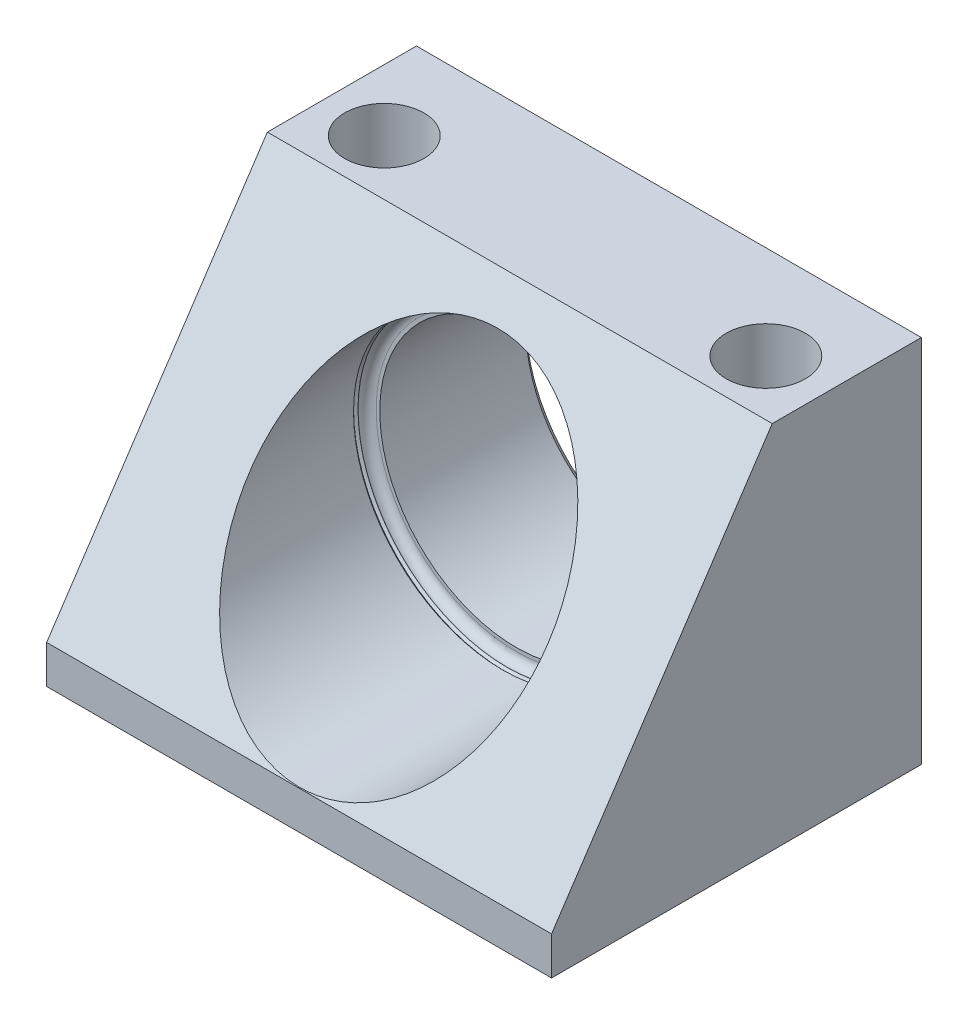
ISO-10303-21;
HEADER;
FILE_DESCRIPTION(('STEP AP214'),'2;1');
FILE_NAME('part.step','',(''),(''),'','','');
FILE_SCHEMA(('AUTOMOTIVE_DESIGN { 1 0 10303 214 1 1 1 1 }'));
ENDSEC;
DATA;
#1=APPLICATION_CONTEXT('core data for automotive mechanical design processes');
#2=APPLICATION_PROTOCOL_DEFINITION('international standard','automotive_design',2000,#1);
#3=PRODUCT_CONTEXT('',#1,'mechanical');
#4=PRODUCT('Part','Part','',(#3));
#5=PRODUCT_RELATED_PRODUCT_CATEGORY('part','',(#4));
#6=PRODUCT_DEFINITION_FORMATION('','',#4);
#7=PRODUCT_DEFINITION_CONTEXT('part definition',#1,'design');
#8=PRODUCT_DEFINITION('design','',#6,#7);
#9=PRODUCT_DEFINITION_SHAPE('','',#8);
#10=(LENGTH_UNIT() NAMED_UNIT(*) SI_UNIT(.MILLI.,.METRE.));
#11=(NAMED_UNIT(*) PLANE_ANGLE_UNIT() SI_UNIT($,.RADIAN.));
#12=(NAMED_UNIT(*) SI_UNIT($,.STERADIAN.) SOLID_ANGLE_UNIT());
#13=UNCERTAINTY_MEASURE_WITH_UNIT(LENGTH_MEASURE(1.E-05),#10,'distance_accuracy_value','');
#14=(GEOMETRIC_REPRESENTATION_CONTEXT(3) GLOBAL_UNCERTAINTY_ASSIGNED_CONTEXT((#13)) GLOBAL_UNIT_ASSIGNED_CONTEXT((#10,
#11,#12)) REPRESENTATION_CONTEXT('',''));
#15=CARTESIAN_POINT('',(0.,0.,0.));
#16=DIRECTION('',(0.,0.,1.));
#17=DIRECTION('',(1.,0.,0.));
#18=AXIS2_PLACEMENT_3D('',#15,#16,#17);
#19=CARTESIAN_POINT('',(0.,0.,-62.992));
#20=DIRECTION('',(0.,0.,1.));
#21=DIRECTION('',(1.,0.,0.));
#22=AXIS2_PLACEMENT_3D('',#19,#20,#21);
#23=CYLINDRICAL_SURFACE('',#22,23.2665);
#24=CARTESIAN_POINT('',(0.,0.,-37.0078));
#25=DIRECTION('',(0.,0.,1.));
#26=DIRECTION('',(1.,0.,0.));
#27=AXIS2_PLACEMENT_3D('',#24,#25,#26);
#28=CIRCLE('',#27,23.2665);
#29=CARTESIAN_POINT('',(23.2665,0.,-37.0078));
#30=VERTEX_POINT('',#29);
#31=EDGE_CURVE('E119',#30,#30,#28,.F.);
#32=ORIENTED_EDGE('',*,*,#31,.F.);
#33=EDGE_LOOP('',(#32));
#34=FACE_BOUND('',#33,.T.);
#35=CARTESIAN_POINT('',(0.,0.,-61.8745));
#36=DIRECTION('',(0.,0.,1.));
#37=DIRECTION('',(1.,0.,0.));
#38=AXIS2_PLACEMENT_3D('',#35,#36,#37);
#39=CIRCLE('',#38,23.2665);
#40=CARTESIAN_POINT('',(23.2665,0.,-61.8745));
#41=VERTEX_POINT('',#40);
#42=EDGE_CURVE('E201',#41,#41,#39,.T.);
#43=ORIENTED_EDGE('',*,*,#42,.F.);
#44=EDGE_LOOP('',(#43));
#45=FACE_BOUND('',#44,.T.);
#46=ADVANCED_FACE('F35',(#34,#45),#23,.F.);
#47=CARTESIAN_POINT('',(-43.0022,-32.004,-62.992));
#48=DIRECTION('',(0.,0.,1.));
#49=DIRECTION('',(1.,0.,0.));
#50=AXIS2_PLACEMENT_3D('',#47,#48,#49);
#51=PLANE('',#50);
#52=DIRECTION('',(0.,-1.,0.));
#53=VECTOR('',#52,1.);
#54=CARTESIAN_POINT('',(-43.0022,30.988,-62.992));
#55=LINE('',#54,#53);
#56=CARTESIAN_POINT('',(-43.0022,30.988,-62.992));
#57=VERTEX_POINT('',#56);
#58=CARTESIAN_POINT('',(-43.0022,-32.004,-62.992));
#59=VERTEX_POINT('',#58);
#60=EDGE_CURVE('E128',#57,#59,#55,.T.);
#61=ORIENTED_EDGE('',*,*,#60,.F.);
#62=DIRECTION('',(-1.,0.,0.));
#63=VECTOR('',#62,1.);
#64=CARTESIAN_POINT('',(-43.0022,30.988,-62.992));
#65=LINE('',#64,#63);
#66=CARTESIAN_POINT('',(43.0022,30.988,-62.992));
#67=VERTEX_POINT('',#66);
#68=EDGE_CURVE('E105',#67,#57,#65,.T.);
#69=ORIENTED_EDGE('',*,*,#68,.F.);
#70=DIRECTION('',(0.,1.,0.));
#71=VECTOR('',#70,1.);
#72=CARTESIAN_POINT('',(43.0022,30.988,-62.992));
#73=LINE('',#72,#71);
#74=CARTESIAN_POINT('',(43.0022,-32.004,-62.992));
#75=VERTEX_POINT('',#74);
#76=EDGE_CURVE('E132',#75,#67,#73,.T.);
#77=ORIENTED_EDGE('',*,*,#76,.F.);
#78=DIRECTION('',(1.,0.,0.));
#79=VECTOR('',#78,1.);
#80=CARTESIAN_POINT('',(-43.0022,-32.004,-62.992));
#81=LINE('',#80,#79);
#82=EDGE_CURVE('E130',#59,#75,#81,.T.);
#83=ORIENTED_EDGE('',*,*,#82,.F.);
#84=EDGE_LOOP('',(#61,#69,#77,#83));
#85=FACE_BOUND('',#84,.T.);
#86=CARTESIAN_POINT('',(0.,0.,-62.992));
#87=DIRECTION('',(0.,0.,1.));
#88=DIRECTION('',(1.,0.,0.));
#89=AXIS2_PLACEMENT_3D('',#86,#87,#88);
#90=CIRCLE('',#89,24.384);
#91=CARTESIAN_POINT('',(24.384,0.,-62.992));
#92=VERTEX_POINT('',#91);
#93=EDGE_CURVE('E204',#92,#92,#90,.T.);
#94=ORIENTED_EDGE('',*,*,#93,.T.);
#95=EDGE_LOOP('',(#94));
#96=FACE_BOUND('',#95,.T.);
#97=ADVANCED_FACE('F145',(#85,#96),#51,.F.);
#98=CARTESIAN_POINT('',(0.,0.,-134.834048968553));
#99=DIRECTION('',(0.,0.,1.));
#100=DIRECTION('',(1.,0.,0.));
#101=AXIS2_PLACEMENT_3D('',#98,#99,#100);
#102=CYLINDRICAL_SURFACE('',#101,25.4);
#103=CARTESIAN_POINT('',(0.,0.,-16.9704892086331));
#104=DIRECTION('',(0.,-0.554008933464055,-0.832510721637878));
#105=DIRECTION('',(0.,-0.832510721637878,0.554008933464055));
#106=AXIS2_PLACEMENT_3D('',#103,#104,#105);
#107=ELLIPSE('',#106,30.5101175754567,25.4);
#108=CARTESIAN_POINT('',(0.,-25.4,-0.0676115107913766));
#109=VERTEX_POINT('',#108);
#110=EDGE_CURVE('E116',#109,#109,#107,.F.);
#111=ORIENTED_EDGE('',*,*,#110,.T.);
#112=EDGE_LOOP('',(#111));
#113=FACE_BOUND('',#112,.T.);
#114=CARTESIAN_POINT('',(0.,0.,-34.671));
#115=DIRECTION('',(0.,0.,1.));
#116=DIRECTION('',(1.,0.,0.));
#117=AXIS2_PLACEMENT_3D('',#114,#115,#116);
#118=CIRCLE('',#117,25.4);
#119=CARTESIAN_POINT('',(25.4,0.,-34.671));
#120=VERTEX_POINT('',#119);
#121=EDGE_CURVE('E198',#120,#120,#118,.T.);
#122=ORIENTED_EDGE('',*,*,#121,.F.);
#123=EDGE_LOOP('',(#122));
#124=FACE_BOUND('',#123,.T.);
#125=ADVANCED_FACE('F166',(#113,#124),#102,.F.);
#126=CARTESIAN_POINT('',(0.,0.,-35.4838));
#127=DIRECTION('',(0.,0.,1.));
#128=DIRECTION('',(1.,0.,0.));
#129=AXIS2_PLACEMENT_3D('',#126,#127,#128);
#130=CIRCLE('',#129,25.4);
#131=CARTESIAN_POINT('',(25.4,0.,-35.4838));
#132=VERTEX_POINT('',#131);
#133=EDGE_CURVE('E12',#132,#132,#130,.F.);
#134=ORIENTED_EDGE('',*,*,#133,.T.);
#135=EDGE_LOOP('',(#134));
#136=FACE_BOUND('',#135,.T.);
#137=CARTESIAN_POINT('',(0.,0.,-35.433));
#138=DIRECTION('',(0.,0.,1.));
#139=DIRECTION('',(1.,0.,0.));
#140=AXIS2_PLACEMENT_3D('',#137,#138,#139);
#141=CIRCLE('',#140,25.4);
#142=CARTESIAN_POINT('',(25.4,0.,-35.433));
#143=VERTEX_POINT('',#142);
#144=EDGE_CURVE('E195',#143,#143,#141,.T.);
#145=ORIENTED_EDGE('',*,*,#144,.T.);
#146=EDGE_LOOP('',(#145));
#147=FACE_BOUND('',#146,.T.);
#148=ADVANCED_FACE('F233',(#136,#147),#102,.F.);
#149=CARTESIAN_POINT('',(-43.0022,30.988,-37.592));
#150=DIRECTION('',(0.,-0.554008933464055,-0.832510721637878));
#151=DIRECTION('',(0.,0.832510721637878,-0.554008933464055));
#152=AXIS2_PLACEMENT_3D('',#149,#150,#151);
#153=PLANE('',#152);
#154=DIRECTION('',(0.,0.832510721637878,-0.554008933464055));
#155=VECTOR('',#154,1.);
#156=CARTESIAN_POINT('',(43.0022,30.988,-37.592));
#157=LINE('',#156,#155);
#158=CARTESIAN_POINT('',(43.0022,-25.5016,0.));
#159=VERTEX_POINT('',#158);
#160=CARTESIAN_POINT('',(43.0022,30.988,-37.592));
#161=VERTEX_POINT('',#160);
#162=EDGE_CURVE('E93',#159,#161,#157,.T.);
#163=ORIENTED_EDGE('',*,*,#162,.T.);
#164=DIRECTION('',(1.,0.,0.));
#165=VECTOR('',#164,1.);
#166=CARTESIAN_POINT('',(-43.0022,30.988,-37.592));
#167=LINE('',#166,#165);
#168=CARTESIAN_POINT('',(-43.0022,30.988,-37.592));
#169=VERTEX_POINT('',#168);
#170=EDGE_CURVE('E89',#169,#161,#167,.T.);
#171=ORIENTED_EDGE('',*,*,#170,.F.);
#172=DIRECTION('',(0.,0.832510721637878,-0.554008933464055));
#173=VECTOR('',#172,1.);
#174=CARTESIAN_POINT('',(-43.0022,30.988,-37.592));
#175=LINE('',#174,#173);
#176=CARTESIAN_POINT('',(-43.0022,-25.5016,0.));
#177=VERTEX_POINT('',#176);
#178=EDGE_CURVE('E50',#177,#169,#175,.T.);
#179=ORIENTED_EDGE('',*,*,#178,.F.);
#180=DIRECTION('',(1.,0.,0.));
#181=VECTOR('',#180,1.);
#182=CARTESIAN_POINT('',(-43.0022,-25.5016,0.));
#183=LINE('',#182,#181);
#184=EDGE_CURVE('E97',#177,#159,#183,.T.);
#185=ORIENTED_EDGE('',*,*,#184,.T.);
#186=EDGE_LOOP('',(#163,#171,#179,#185));
#187=FACE_BOUND('',#186,.T.);
#188=ORIENTED_EDGE('',*,*,#110,.F.);
#189=EDGE_LOOP('',(#188));
#190=FACE_BOUND('',#189,.T.);
#191=ADVANCED_FACE('F90',(#187,#190),#153,.F.);
#192=CARTESIAN_POINT('',(-43.0022,30.988,-62.992));
#193=DIRECTION('',(-1.,0.,0.));
#194=DIRECTION('',(0.,-1.,0.));
#195=AXIS2_PLACEMENT_3D('',#192,#193,#194);
#196=PLANE('',#195);
#197=ORIENTED_EDGE('',*,*,#178,.T.);
#198=DIRECTION('',(0.,0.,1.));
#199=VECTOR('',#198,1.);
#200=CARTESIAN_POINT('',(-43.0022,30.988,-62.992));
#201=LINE('',#200,#199);
#202=EDGE_CURVE('E58',#57,#169,#201,.T.);
#203=ORIENTED_EDGE('',*,*,#202,.F.);
#204=ORIENTED_EDGE('',*,*,#60,.T.);
#205=DIRECTION('',(0.,0.,1.));
#206=VECTOR('',#205,1.);
#207=CARTESIAN_POINT('',(-43.0022,-32.004,-62.992));
#208=LINE('',#207,#206);
#209=CARTESIAN_POINT('',(-43.0022,-32.004,0.));
#210=VERTEX_POINT('',#209);
#211=EDGE_CURVE('E80',#59,#210,#208,.T.);
#212=ORIENTED_EDGE('',*,*,#211,.T.);
#213=DIRECTION('',(0.,-1.,0.));
#214=VECTOR('',#213,1.);
#215=CARTESIAN_POINT('',(-43.0022,30.988,0.));
#216=LINE('',#215,#214);
#217=EDGE_CURVE('E96',#177,#210,#216,.T.);
#218=ORIENTED_EDGE('',*,*,#217,.F.);
#219=EDGE_LOOP('',(#197,#203,#204,#212,#218));
#220=FACE_BOUND('',#219,.T.);
#221=ADVANCED_FACE('F100',(#220),#196,.T.);
#222=CARTESIAN_POINT('',(-43.0022,30.988,-62.992));
#223=DIRECTION('',(0.,1.,0.));
#224=DIRECTION('',(0.,0.,1.));
#225=AXIS2_PLACEMENT_3D('',#222,#223,#224);
#226=PLANE('',#225);
#227=CARTESIAN_POINT('',(-32.512,30.988,-47.0154));
#228=DIRECTION('',(0.,1.,0.));
#229=DIRECTION('',(0.,0.,1.));
#230=AXIS2_PLACEMENT_3D('',#227,#228,#229);
#231=CIRCLE('',#230,6.74370000000001);
#232=CARTESIAN_POINT('',(-32.512,30.988,-40.2717));
#233=VERTEX_POINT('',#232);
#234=EDGE_CURVE('E180',#233,#233,#231,.T.);
#235=ORIENTED_EDGE('',*,*,#234,.F.);
#236=EDGE_LOOP('',(#235));
#237=FACE_BOUND('',#236,.T.);
#238=CARTESIAN_POINT('',(32.4866,30.988,-47.0154));
#239=DIRECTION('',(0.,1.,0.));
#240=DIRECTION('',(0.,0.,1.));
#241=AXIS2_PLACEMENT_3D('',#238,#239,#240);
#242=CIRCLE('',#241,6.74370000000001);
#243=CARTESIAN_POINT('',(32.4866,30.988,-40.2717));
#244=VERTEX_POINT('',#243);
#245=EDGE_CURVE('E183',#244,#244,#242,.T.);
#246=ORIENTED_EDGE('',*,*,#245,.F.);
#247=EDGE_LOOP('',(#246));
#248=FACE_BOUND('',#247,.T.);
#249=ORIENTED_EDGE('',*,*,#170,.T.);
#250=DIRECTION('',(0.,0.,1.));
#251=VECTOR('',#250,1.);
#252=CARTESIAN_POINT('',(43.0022,30.988,-62.992));
#253=LINE('',#252,#251);
#254=EDGE_CURVE('E106',#67,#161,#253,.T.);
#255=ORIENTED_EDGE('',*,*,#254,.F.);
#256=ORIENTED_EDGE('',*,*,#68,.T.);
#257=ORIENTED_EDGE('',*,*,#202,.T.);
#258=EDGE_LOOP('',(#249,#255,#256,#257));
#259=FACE_BOUND('',#258,.T.);
#260=ADVANCED_FACE('F103',(#237,#248,#259),#226,.T.);
#261=CARTESIAN_POINT('',(43.0022,30.988,-62.992));
#262=DIRECTION('',(1.,0.,0.));
#263=DIRECTION('',(0.,1.,0.));
#264=AXIS2_PLACEMENT_3D('',#261,#262,#263);
#265=PLANE('',#264);
#266=ORIENTED_EDGE('',*,*,#162,.F.);
#267=DIRECTION('',(0.,1.,0.));
#268=VECTOR('',#267,1.);
#269=CARTESIAN_POINT('',(43.0022,30.988,0.));
#270=LINE('',#269,#268);
#271=CARTESIAN_POINT('',(43.0022,-32.004,0.));
#272=VERTEX_POINT('',#271);
#273=EDGE_CURVE('E111',#272,#159,#270,.T.);
#274=ORIENTED_EDGE('',*,*,#273,.F.);
#275=DIRECTION('',(0.,0.,1.));
#276=VECTOR('',#275,1.);
#277=CARTESIAN_POINT('',(43.0022,-32.004,-62.992));
#278=LINE('',#277,#276);
#279=EDGE_CURVE('E75',#75,#272,#278,.T.);
#280=ORIENTED_EDGE('',*,*,#279,.F.);
#281=ORIENTED_EDGE('',*,*,#76,.T.);
#282=ORIENTED_EDGE('',*,*,#254,.T.);
#283=EDGE_LOOP('',(#266,#274,#280,#281,#282));
#284=FACE_BOUND('',#283,.T.);
#285=ADVANCED_FACE('F142',(#284),#265,.T.);
#286=CARTESIAN_POINT('',(-43.0022,-32.004,-62.992));
#287=DIRECTION('',(0.,-1.,0.));
#288=DIRECTION('',(0.,0.,-1.));
#289=AXIS2_PLACEMENT_3D('',#286,#287,#288);
#290=PLANE('',#289);
#291=CARTESIAN_POINT('',(-32.512,-32.004,-47.0154));
#292=DIRECTION('',(0.,-1.,0.));
#293=DIRECTION('',(0.,0.,-1.));
#294=AXIS2_PLACEMENT_3D('',#291,#292,#293);
#295=CIRCLE('',#294,6.74370000000001);
#296=CARTESIAN_POINT('',(-32.512,-32.004,-53.7591));
#297=VERTEX_POINT('',#296);
#298=EDGE_CURVE('E185',#297,#297,#295,.T.);
#299=ORIENTED_EDGE('',*,*,#298,.F.);
#300=EDGE_LOOP('',(#299));
#301=FACE_BOUND('',#300,.T.);
#302=CARTESIAN_POINT('',(32.4866,-32.004,-47.0154));
#303=DIRECTION('',(0.,-1.,0.));
#304=DIRECTION('',(0.,0.,-1.));
#305=AXIS2_PLACEMENT_3D('',#302,#303,#304);
#306=CIRCLE('',#305,6.74370000000001);
#307=CARTESIAN_POINT('',(32.4866,-32.004,-53.7591));
#308=VERTEX_POINT('',#307);
#309=EDGE_CURVE('E120',#308,#308,#306,.T.);
#310=ORIENTED_EDGE('',*,*,#309,.F.);
#311=EDGE_LOOP('',(#310));
#312=FACE_BOUND('',#311,.T.);
#313=DIRECTION('',(1.,0.,0.));
#314=VECTOR('',#313,1.);
#315=CARTESIAN_POINT('',(-43.0022,-32.004,0.));
#316=LINE('',#315,#314);
#317=EDGE_CURVE('E136',#210,#272,#316,.T.);
#318=ORIENTED_EDGE('',*,*,#317,.F.);
#319=ORIENTED_EDGE('',*,*,#211,.F.);
#320=ORIENTED_EDGE('',*,*,#82,.T.);
#321=ORIENTED_EDGE('',*,*,#279,.T.);
#322=EDGE_LOOP('',(#318,#319,#320,#321));
#323=FACE_BOUND('',#322,.T.);
#324=ADVANCED_FACE('F147',(#301,#312,#323),#290,.T.);
#325=CARTESIAN_POINT('',(-43.0022,-32.004,0.));
#326=DIRECTION('',(0.,0.,1.));
#327=DIRECTION('',(1.,0.,0.));
#328=AXIS2_PLACEMENT_3D('',#325,#326,#327);
#329=PLANE('',#328);
#330=ORIENTED_EDGE('',*,*,#184,.F.);
#331=ORIENTED_EDGE('',*,*,#217,.T.);
#332=ORIENTED_EDGE('',*,*,#317,.T.);
#333=ORIENTED_EDGE('',*,*,#273,.T.);
#334=EDGE_LOOP('',(#330,#331,#332,#333));
#335=FACE_BOUND('',#334,.T.);
#336=ADVANCED_FACE('F140',(#335),#329,.T.);
#337=CARTESIAN_POINT('',(-43.0022,-32.004,-37.0078));
#338=DIRECTION('',(0.,0.,1.));
#339=DIRECTION('',(1.,0.,0.));
#340=AXIS2_PLACEMENT_3D('',#337,#338,#339);
#341=PLANE('',#340);
#342=CARTESIAN_POINT('',(0.,0.,-37.0078));
#343=DIRECTION('',(0.,0.,1.));
#344=DIRECTION('',(1.,0.,0.));
#345=AXIS2_PLACEMENT_3D('',#342,#343,#344);
#346=CIRCLE('',#345,23.876);
#347=CARTESIAN_POINT('',(23.876,0.,-37.0078));
#348=VERTEX_POINT('',#347);
#349=EDGE_CURVE('E43',#348,#348,#346,.T.);
#350=ORIENTED_EDGE('',*,*,#349,.T.);
#351=EDGE_LOOP('',(#350));
#352=FACE_BOUND('',#351,.T.);
#353=ORIENTED_EDGE('',*,*,#31,.T.);
#354=EDGE_LOOP('',(#353));
#355=FACE_BOUND('',#354,.T.);
#356=ADVANCED_FACE('F155',(#352,#355),#341,.T.);
#357=CARTESIAN_POINT('',(0.,0.,-35.4838));
#358=DIRECTION('',(0.,0.,1.));
#359=DIRECTION('',(1.,0.,0.));
#360=AXIS2_PLACEMENT_3D('',#357,#358,#359);
#361=TOROIDAL_SURFACE('',#360,23.876,1.524);
#362=ORIENTED_EDGE('',*,*,#133,.F.);
#363=EDGE_LOOP('',(#362));
#364=FACE_BOUND('',#363,.T.);
#365=ORIENTED_EDGE('',*,*,#349,.F.);
#366=EDGE_LOOP('',(#365));
#367=FACE_BOUND('',#366,.T.);
#368=ADVANCED_FACE('F37',(#364,#367),#361,.F.);
#369=CARTESIAN_POINT('',(32.4866,30.988,-47.0154));
#370=DIRECTION('',(0.,1.,0.));
#371=DIRECTION('',(0.,0.,1.));
#372=AXIS2_PLACEMENT_3D('',#369,#370,#371);
#373=CYLINDRICAL_SURFACE('',#372,6.74370000000001);
#374=ORIENTED_EDGE('',*,*,#245,.T.);
#375=EDGE_LOOP('',(#374));
#376=FACE_BOUND('',#375,.T.);
#377=ORIENTED_EDGE('',*,*,#309,.T.);
#378=EDGE_LOOP('',(#377));
#379=FACE_BOUND('',#378,.T.);
#380=ADVANCED_FACE('F226',(#376,#379),#373,.F.);
#381=CARTESIAN_POINT('',(-32.512,30.988,-47.0154));
#382=DIRECTION('',(0.,1.,0.));
#383=DIRECTION('',(0.,0.,1.));
#384=AXIS2_PLACEMENT_3D('',#381,#382,#383);
#385=CYLINDRICAL_SURFACE('',#384,6.74370000000001);
#386=ORIENTED_EDGE('',*,*,#234,.T.);
#387=EDGE_LOOP('',(#386));
#388=FACE_BOUND('',#387,.T.);
#389=ORIENTED_EDGE('',*,*,#298,.T.);
#390=EDGE_LOOP('',(#389));
#391=FACE_BOUND('',#390,.T.);
#392=ADVANCED_FACE('F222',(#388,#391),#385,.F.);
#393=CARTESIAN_POINT('',(0.,0.,-35.052));
#394=DIRECTION('',(0.,0.,-1.));
#395=DIRECTION('',(-1.,0.,0.));
#396=AXIS2_PLACEMENT_3D('',#393,#394,#395);
#397=CONICAL_SURFACE('',#396,25.781,0.785398163397457);
#398=ORIENTED_EDGE('',*,*,#121,.T.);
#399=EDGE_LOOP('',(#398));
#400=FACE_BOUND('',#399,.T.);
#401=CARTESIAN_POINT('',(0.,0.,-35.052));
#402=DIRECTION('',(0.,0.,1.));
#403=DIRECTION('',(1.,0.,0.));
#404=AXIS2_PLACEMENT_3D('',#401,#402,#403);
#405=CIRCLE('',#404,25.781);
#406=CARTESIAN_POINT('',(25.781,0.,-35.052));
#407=VERTEX_POINT('',#406);
#408=EDGE_CURVE('E192',#407,#407,#405,.T.);
#409=ORIENTED_EDGE('',*,*,#408,.F.);
#410=EDGE_LOOP('',(#409));
#411=FACE_BOUND('',#410,.T.);
#412=ADVANCED_FACE('F216',(#400,#411),#397,.F.);
#413=CARTESIAN_POINT('',(0.,0.,-35.433));
#414=DIRECTION('',(0.,0.,1.));
#415=DIRECTION('',(1.,0.,0.));
#416=AXIS2_PLACEMENT_3D('',#413,#414,#415);
#417=CONICAL_SURFACE('',#416,25.4,0.785398163397435);
#418=ORIENTED_EDGE('',*,*,#408,.T.);
#419=EDGE_LOOP('',(#418));
#420=FACE_BOUND('',#419,.T.);
#421=ORIENTED_EDGE('',*,*,#144,.F.);
#422=EDGE_LOOP('',(#421));
#423=FACE_BOUND('',#422,.T.);
#424=ADVANCED_FACE('F210',(#420,#423),#417,.F.);
#425=CARTESIAN_POINT('',(0.,0.,-62.992));
#426=DIRECTION('',(0.,0.,-1.));
#427=DIRECTION('',(-1.,0.,0.));
#428=AXIS2_PLACEMENT_3D('',#425,#426,#427);
#429=CONICAL_SURFACE('',#428,24.384,0.785398163397448);
#430=ORIENTED_EDGE('',*,*,#42,.T.);
#431=EDGE_LOOP('',(#430));
#432=FACE_BOUND('',#431,.T.);
#433=ORIENTED_EDGE('',*,*,#93,.F.);
#434=EDGE_LOOP('',(#433));
#435=FACE_BOUND('',#434,.T.);
#436=ADVANCED_FACE('F208',(#432,#435),#429,.F.);
#437=CLOSED_SHELL('',(#46,#97,#125,#148,#191,#221,#260,#285,#324,#336,#356,#368,#380,#392,#412,
#424,#436));
#438=MANIFOLD_SOLID_BREP('B2',#437);
#439=ADVANCED_BREP_SHAPE_REPRESENTATION('',(#18,#438),#14);
#440=SHAPE_DEFINITION_REPRESENTATION(#9,#439);
ENDSEC;
END-ISO-10303-21;
